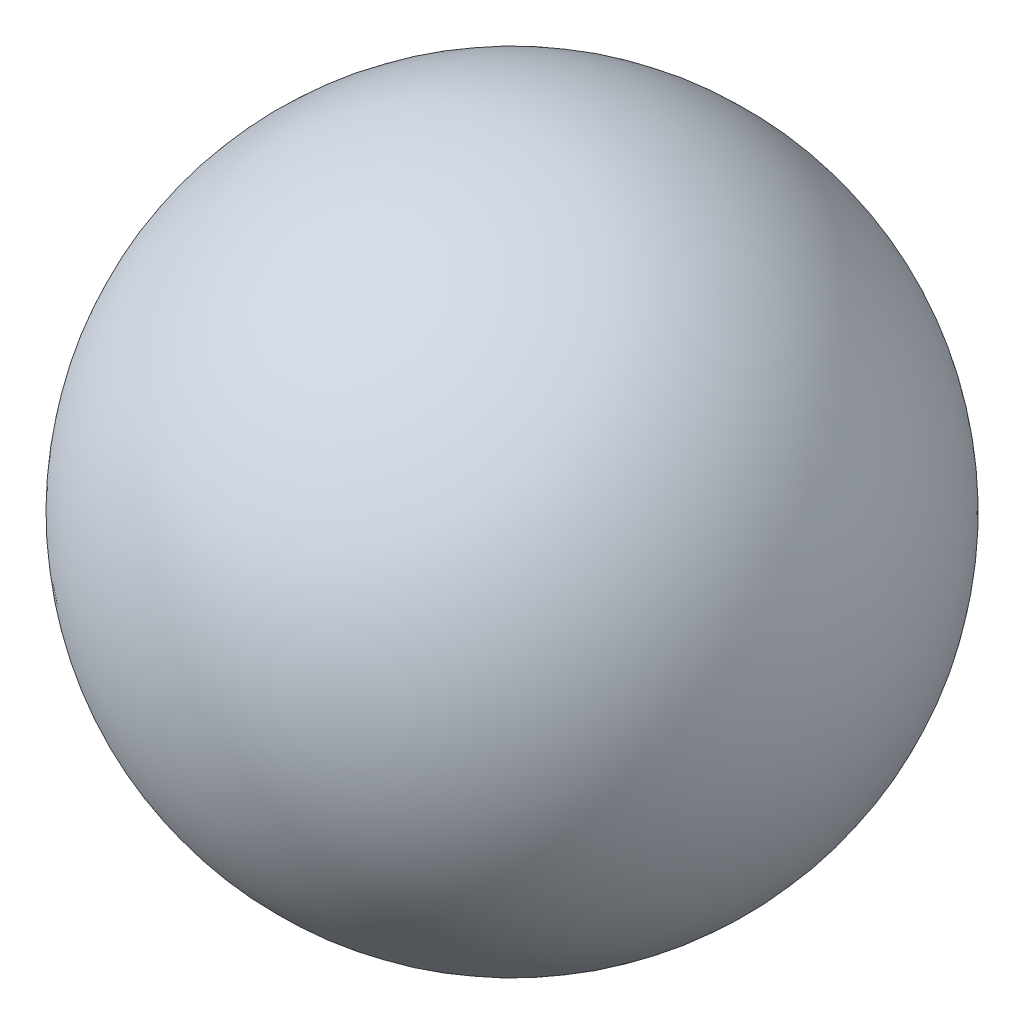
ISO-10303-21;
HEADER;
FILE_DESCRIPTION(('STEP AP214'),'2;1');
FILE_NAME('part.step','',(''),(''),'','','');
FILE_SCHEMA(('AUTOMOTIVE_DESIGN { 1 0 10303 214 1 1 1 1 }'));
ENDSEC;
DATA;
#1=APPLICATION_CONTEXT('core data for automotive mechanical design processes');
#2=APPLICATION_PROTOCOL_DEFINITION('international standard','automotive_design',2000,#1);
#3=PRODUCT_CONTEXT('',#1,'mechanical');
#4=PRODUCT('Part','Part','',(#3));
#5=PRODUCT_RELATED_PRODUCT_CATEGORY('part','',(#4));
#6=PRODUCT_DEFINITION_FORMATION('','',#4);
#7=PRODUCT_DEFINITION_CONTEXT('part definition',#1,'design');
#8=PRODUCT_DEFINITION('design','',#6,#7);
#9=PRODUCT_DEFINITION_SHAPE('','',#8);
#10=(LENGTH_UNIT() NAMED_UNIT(*) SI_UNIT(.MILLI.,.METRE.));
#11=(NAMED_UNIT(*) PLANE_ANGLE_UNIT() SI_UNIT($,.RADIAN.));
#12=(NAMED_UNIT(*) SI_UNIT($,.STERADIAN.) SOLID_ANGLE_UNIT());
#13=UNCERTAINTY_MEASURE_WITH_UNIT(LENGTH_MEASURE(1.E-05),#10,'distance_accuracy_value','');
#14=(GEOMETRIC_REPRESENTATION_CONTEXT(3) GLOBAL_UNCERTAINTY_ASSIGNED_CONTEXT((#13)) GLOBAL_UNIT_ASSIGNED_CONTEXT((#10,
#11,#12)) REPRESENTATION_CONTEXT('',''));
#15=CARTESIAN_POINT('',(0.,0.,0.));
#16=DIRECTION('',(0.,0.,1.));
#17=DIRECTION('',(1.,0.,0.));
#18=AXIS2_PLACEMENT_3D('',#15,#16,#17);
#19=CARTESIAN_POINT('',(0.,0.,0.));
#20=DIRECTION('',(0.759473182639602,0.617025831571144,0.206105817543352));
#21=DIRECTION('',(-0.376413075566615,0.158405561096892,0.912809330997477));
#22=AXIS2_PLACEMENT_3D('',#19,#20,#21);
#23=SPHERICAL_SURFACE('',#22,1.1905);
#24=CARTESIAN_POINT('',(0.904152823932445,0.734569252485446,0.24536897578536));
#25=VERTEX_POINT('',#24);
#26=VERTEX_LOOP('',#25);
#27=FACE_BOUND('',#26,.T.);
#28=CARTESIAN_POINT('',(-0.904152823932446,-0.734569252485446,-0.24536897578536));
#29=VERTEX_POINT('',#28);
#30=VERTEX_LOOP('',#29);
#31=FACE_BOUND('',#30,.T.);
#32=ADVANCED_FACE('F15',(#27,#31),#23,.T.);
#33=CLOSED_SHELL('',(#32));
#34=MANIFOLD_SOLID_BREP('B1',#33);
#35=ADVANCED_BREP_SHAPE_REPRESENTATION('',(#18,#34),#14);
#36=SHAPE_DEFINITION_REPRESENTATION(#9,#35);
ENDSEC;
END-ISO-10303-21;
